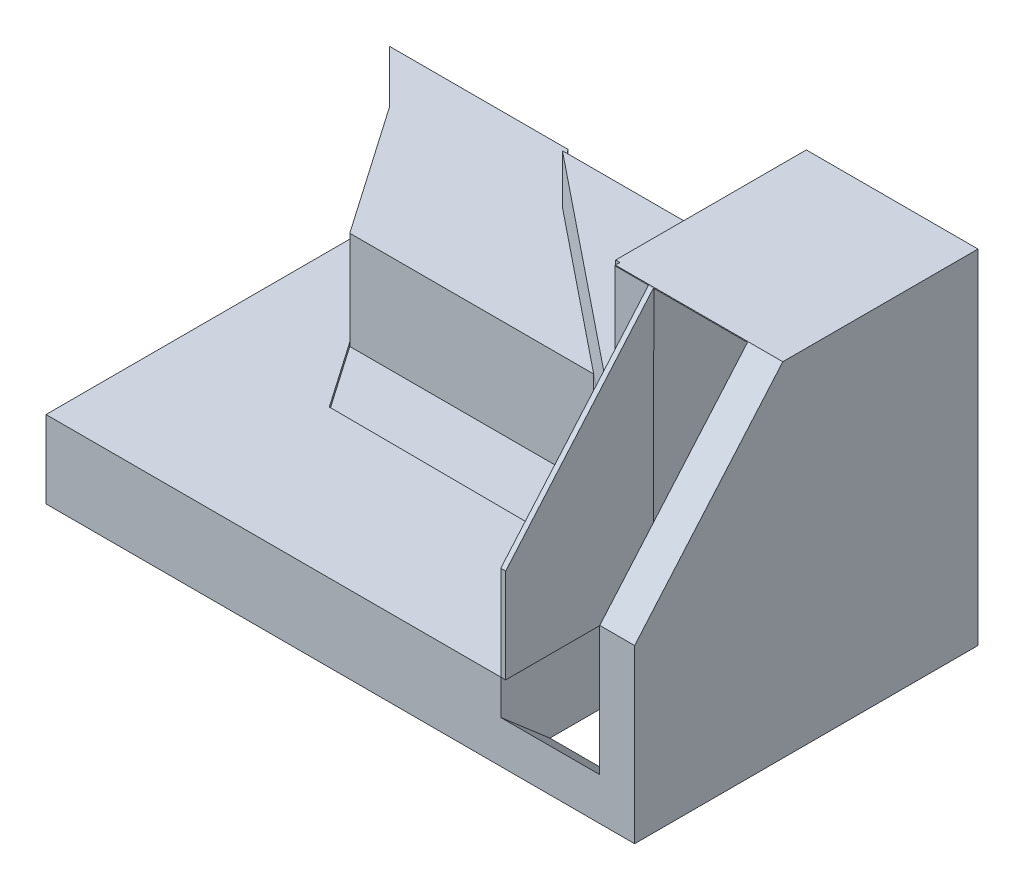
ISO-10303-21;
HEADER;
FILE_DESCRIPTION(('STEP AP214'),'2;1');
FILE_NAME('part.step','',(''),(''),'','','');
FILE_SCHEMA(('AUTOMOTIVE_DESIGN { 1 0 10303 214 1 1 1 1 }'));
ENDSEC;
DATA;
#1=APPLICATION_CONTEXT('core data for automotive mechanical design processes');
#2=APPLICATION_PROTOCOL_DEFINITION('international standard','automotive_design',2000,#1);
#3=PRODUCT_CONTEXT('',#1,'mechanical');
#4=PRODUCT('Part','Part','',(#3));
#5=PRODUCT_RELATED_PRODUCT_CATEGORY('part','',(#4));
#6=PRODUCT_DEFINITION_FORMATION('','',#4);
#7=PRODUCT_DEFINITION_CONTEXT('part definition',#1,'design');
#8=PRODUCT_DEFINITION('design','',#6,#7);
#9=PRODUCT_DEFINITION_SHAPE('','',#8);
#10=(LENGTH_UNIT() NAMED_UNIT(*) SI_UNIT(.MILLI.,.METRE.));
#11=(NAMED_UNIT(*) PLANE_ANGLE_UNIT() SI_UNIT($,.RADIAN.));
#12=(NAMED_UNIT(*) SI_UNIT($,.STERADIAN.) SOLID_ANGLE_UNIT());
#13=UNCERTAINTY_MEASURE_WITH_UNIT(LENGTH_MEASURE(1.E-05),#10,'distance_accuracy_value','');
#14=(GEOMETRIC_REPRESENTATION_CONTEXT(3) GLOBAL_UNCERTAINTY_ASSIGNED_CONTEXT((#13)) GLOBAL_UNIT_ASSIGNED_CONTEXT((#10,
#11,#12)) REPRESENTATION_CONTEXT('',''));
#15=CARTESIAN_POINT('',(0.,0.,0.));
#16=DIRECTION('',(0.,0.,1.));
#17=DIRECTION('',(1.,0.,0.));
#18=AXIS2_PLACEMENT_3D('',#15,#16,#17);
#19=CARTESIAN_POINT('',(43.8303252102302,10.,39.8821006189172));
#20=DIRECTION('',(0.,0.0016196403228152,0.999998688381752));
#21=DIRECTION('',(0.,-0.999998688381752,0.0016196403228152));
#22=AXIS2_PLACEMENT_3D('',#19,#20,#21);
#23=PLANE('',#22);
#24=DIRECTION('',(0.,0.999998688381752,-0.0016196403228152));
#25=VECTOR('',#24,1.);
#26=CARTESIAN_POINT('',(42.8303252102302,10.,39.8821006189172));
#27=LINE('',#26,#25);
#28=CARTESIAN_POINT('',(42.8303252102302,10.,39.8821006189172));
#29=VERTEX_POINT('',#28);
#30=CARTESIAN_POINT('',(42.8303252102302,64.2168674698795,39.7942886790105));
#31=VERTEX_POINT('',#30);
#32=EDGE_CURVE('E110',#29,#31,#27,.T.);
#33=ORIENTED_EDGE('',*,*,#32,.T.);
#34=DIRECTION('',(-1.,0.,0.));
#35=VECTOR('',#34,1.);
#36=CARTESIAN_POINT('',(43.8303252102302,64.2168674698795,39.7942886790105));
#37=LINE('',#36,#35);
#38=CARTESIAN_POINT('',(43.8303252102302,64.2168674698795,39.7942886790105));
#39=VERTEX_POINT('',#38);
#40=EDGE_CURVE('E12',#39,#31,#37,.T.);
#41=ORIENTED_EDGE('',*,*,#40,.F.);
#42=DIRECTION('',(0.,0.999998688381752,-0.0016196403228152));
#43=VECTOR('',#42,1.);
#44=CARTESIAN_POINT('',(43.8303252102302,10.,39.8821006189172));
#45=LINE('',#44,#43);
#46=CARTESIAN_POINT('',(43.8303252102302,10.,39.8821006189172));
#47=VERTEX_POINT('',#46);
#48=EDGE_CURVE('E97',#47,#39,#45,.T.);
#49=ORIENTED_EDGE('',*,*,#48,.F.);
#50=DIRECTION('',(-1.,0.,0.));
#51=VECTOR('',#50,1.);
#52=CARTESIAN_POINT('',(43.8303252102302,10.,39.8821006189172));
#53=LINE('',#52,#51);
#54=EDGE_CURVE('E106',#47,#29,#53,.T.);
#55=ORIENTED_EDGE('',*,*,#54,.T.);
#56=EDGE_LOOP('',(#33,#41,#49,#55));
#57=FACE_BOUND('',#56,.T.);
#58=ADVANCED_FACE('F47',(#57),#23,.F.);
#59=CARTESIAN_POINT('',(43.8303252102302,64.2168674698795,39.7942886790105));
#60=DIRECTION('',(0.,-0.653352698589413,-0.757053664706757));
#61=DIRECTION('',(0.,0.757053664706757,-0.653352698589413));
#62=AXIS2_PLACEMENT_3D('',#59,#60,#61);
#63=PLANE('',#62);
#64=DIRECTION('',(0.,-0.757053664706757,0.653352698589413));
#65=VECTOR('',#64,1.);
#66=CARTESIAN_POINT('',(42.8303252102302,64.2168674698795,39.7942886790105));
#67=LINE('',#66,#65);
#68=CARTESIAN_POINT('',(42.8303252102302,29.2168674698795,70.));
#69=VERTEX_POINT('',#68);
#70=EDGE_CURVE('E102',#31,#69,#67,.T.);
#71=ORIENTED_EDGE('',*,*,#70,.T.);
#72=DIRECTION('',(-1.,0.,0.));
#73=VECTOR('',#72,1.);
#74=CARTESIAN_POINT('',(43.8303252102302,29.2168674698795,70.));
#75=LINE('',#74,#73);
#76=CARTESIAN_POINT('',(43.8303252102302,29.2168674698795,70.));
#77=VERTEX_POINT('',#76);
#78=EDGE_CURVE('E55',#77,#69,#75,.T.);
#79=ORIENTED_EDGE('',*,*,#78,.F.);
#80=DIRECTION('',(0.,-0.757053664706757,0.653352698589413));
#81=VECTOR('',#80,1.);
#82=CARTESIAN_POINT('',(43.8303252102302,64.2168674698795,39.7942886790105));
#83=LINE('',#82,#81);
#84=EDGE_CURVE('E92',#39,#77,#83,.T.);
#85=ORIENTED_EDGE('',*,*,#84,.F.);
#86=ORIENTED_EDGE('',*,*,#40,.T.);
#87=EDGE_LOOP('',(#71,#79,#85,#86));
#88=FACE_BOUND('',#87,.T.);
#89=ADVANCED_FACE('F101',(#88),#63,.F.);
#90=CARTESIAN_POINT('',(43.8303252102302,11.7168674698795,70.));
#91=DIRECTION('',(0.,0.,-1.));
#92=DIRECTION('',(0.,1.,0.));
#93=AXIS2_PLACEMENT_3D('',#90,#91,#92);
#94=PLANE('',#93);
#95=DIRECTION('',(0.,-1.,0.));
#96=VECTOR('',#95,1.);
#97=CARTESIAN_POINT('',(42.8303252102302,11.7168674698795,70.));
#98=LINE('',#97,#96);
#99=CARTESIAN_POINT('',(42.8303252102302,10.,70.));
#100=VERTEX_POINT('',#99);
#101=EDGE_CURVE('E79',#69,#100,#98,.T.);
#102=ORIENTED_EDGE('',*,*,#101,.T.);
#103=DIRECTION('',(-1.,0.,0.));
#104=VECTOR('',#103,1.);
#105=CARTESIAN_POINT('',(43.8303252102302,10.,70.));
#106=LINE('',#105,#104);
#107=CARTESIAN_POINT('',(43.8303252102302,10.,70.));
#108=VERTEX_POINT('',#107);
#109=EDGE_CURVE('E103',#108,#100,#106,.T.);
#110=ORIENTED_EDGE('',*,*,#109,.F.);
#111=DIRECTION('',(0.,-1.,0.));
#112=VECTOR('',#111,1.);
#113=CARTESIAN_POINT('',(43.8303252102302,29.2168674698795,70.));
#114=LINE('',#113,#112);
#115=EDGE_CURVE('E95',#77,#108,#114,.T.);
#116=ORIENTED_EDGE('',*,*,#115,.F.);
#117=ORIENTED_EDGE('',*,*,#78,.T.);
#118=EDGE_LOOP('',(#102,#110,#116,#117));
#119=FACE_BOUND('',#118,.T.);
#120=ADVANCED_FACE('F104',(#119),#94,.F.);
#121=CARTESIAN_POINT('',(43.8303252102302,10.,70.));
#122=DIRECTION('',(0.,1.,0.));
#123=DIRECTION('',(0.,0.,1.));
#124=AXIS2_PLACEMENT_3D('',#121,#122,#123);
#125=PLANE('',#124);
#126=DIRECTION('',(0.,0.,-1.));
#127=VECTOR('',#126,1.);
#128=CARTESIAN_POINT('',(42.8303252102302,10.,70.));
#129=LINE('',#128,#127);
#130=EDGE_CURVE('E85',#100,#29,#129,.T.);
#131=ORIENTED_EDGE('',*,*,#130,.T.);
#132=ORIENTED_EDGE('',*,*,#54,.F.);
#133=DIRECTION('',(0.,0.,-1.));
#134=VECTOR('',#133,1.);
#135=CARTESIAN_POINT('',(43.8303252102302,10.,70.));
#136=LINE('',#135,#134);
#137=EDGE_CURVE('E63',#108,#47,#136,.T.);
#138=ORIENTED_EDGE('',*,*,#137,.F.);
#139=ORIENTED_EDGE('',*,*,#109,.T.);
#140=EDGE_LOOP('',(#131,#132,#138,#139));
#141=FACE_BOUND('',#140,.T.);
#142=ADVANCED_FACE('F117',(#141),#125,.F.);
#143=CARTESIAN_POINT('',(43.8303252102302,0.,0.));
#144=DIRECTION('',(-1.,0.,0.));
#145=DIRECTION('',(0.,0.,1.));
#146=AXIS2_PLACEMENT_3D('',#143,#144,#145);
#147=PLANE('',#146);
#148=ORIENTED_EDGE('',*,*,#48,.T.);
#149=ORIENTED_EDGE('',*,*,#84,.T.);
#150=ORIENTED_EDGE('',*,*,#115,.T.);
#151=ORIENTED_EDGE('',*,*,#137,.T.);
#152=EDGE_LOOP('',(#148,#149,#150,#151));
#153=FACE_BOUND('',#152,.T.);
#154=ADVANCED_FACE('F93',(#153),#147,.F.);
#155=CARTESIAN_POINT('',(42.8303252102302,0.,0.));
#156=DIRECTION('',(-1.,0.,0.));
#157=DIRECTION('',(0.,0.,1.));
#158=AXIS2_PLACEMENT_3D('',#155,#156,#157);
#159=PLANE('',#158);
#160=ORIENTED_EDGE('',*,*,#32,.F.);
#161=ORIENTED_EDGE('',*,*,#130,.F.);
#162=ORIENTED_EDGE('',*,*,#101,.F.);
#163=ORIENTED_EDGE('',*,*,#70,.F.);
#164=EDGE_LOOP('',(#160,#161,#162,#163));
#165=FACE_BOUND('',#164,.T.);
#166=ADVANCED_FACE('F120',(#165),#159,.T.);
#167=CLOSED_SHELL('',(#58,#89,#120,#142,#154,#166));
#168=MANIFOLD_SOLID_BREP('B2',#167);
#169=CARTESIAN_POINT('',(35.1204819277108,39.2168674698795,0.));
#170=DIRECTION('',(1.,0.,0.));
#171=DIRECTION('',(0.,0.,-1.));
#172=AXIS2_PLACEMENT_3D('',#169,#170,#171);
#173=PLANE('',#172);
#174=DIRECTION('',(0.,-1.,0.));
#175=VECTOR('',#174,1.);
#176=CARTESIAN_POINT('',(35.1204819277108,39.2168674698795,38.8717088419266));
#177=LINE('',#176,#175);
#178=CARTESIAN_POINT('',(35.1204819277108,64.2168674698795,38.8717088419266));
#179=VERTEX_POINT('',#178);
#180=CARTESIAN_POINT('',(35.1204819277108,39.2168674698795,38.8717088419266));
#181=VERTEX_POINT('',#180);
#182=EDGE_CURVE('E428',#179,#181,#177,.T.);
#183=ORIENTED_EDGE('',*,*,#182,.F.);
#184=DIRECTION('',(0.,0.,-1.));
#185=VECTOR('',#184,1.);
#186=CARTESIAN_POINT('',(35.1204819277108,64.2168674698795,0.));
#187=LINE('',#186,#185);
#188=CARTESIAN_POINT('',(35.1204819277108,64.2168674698795,0.));
#189=VERTEX_POINT('',#188);
#190=EDGE_CURVE('E482',#179,#189,#187,.T.);
#191=ORIENTED_EDGE('',*,*,#190,.T.);
#192=DIRECTION('',(0.,1.,0.));
#193=VECTOR('',#192,1.);
#194=CARTESIAN_POINT('',(35.1204819277108,39.2168674698795,0.));
#195=LINE('',#194,#193);
#196=CARTESIAN_POINT('',(35.1204819277108,39.2168674698795,0.));
#197=VERTEX_POINT('',#196);
#198=EDGE_CURVE('E488',#197,#189,#195,.T.);
#199=ORIENTED_EDGE('',*,*,#198,.F.);
#200=DIRECTION('',(0.,0.,-1.));
#201=VECTOR('',#200,1.);
#202=CARTESIAN_POINT('',(35.1204819277108,39.2168674698795,0.));
#203=LINE('',#202,#201);
#204=EDGE_CURVE('E483',#181,#197,#203,.T.);
#205=ORIENTED_EDGE('',*,*,#204,.F.);
#206=EDGE_LOOP('',(#183,#191,#199,#205));
#207=FACE_BOUND('',#206,.T.);
#208=ADVANCED_FACE('F174',(#207),#173,.F.);
#209=CARTESIAN_POINT('',(0.,39.2168674698795,0.));
#210=DIRECTION('',(0.,-1.,0.));
#211=DIRECTION('',(0.,0.,-1.));
#212=AXIS2_PLACEMENT_3D('',#209,#210,#211);
#213=PLANE('',#212);
#214=DIRECTION('',(-0.999999091798879,0.,-0.00134773937301897));
#215=VECTOR('',#214,1.);
#216=CARTESIAN_POINT('',(-0.0523250920299473,39.2168674698795,38.8243050219943));
#217=LINE('',#216,#215);
#218=CARTESIAN_POINT('',(33.7143475226182,39.2168674698795,38.869813737504));
#219=VERTEX_POINT('',#218);
#220=EDGE_CURVE('E426',#181,#219,#217,.T.);
#221=ORIENTED_EDGE('',*,*,#220,.F.);
#222=ORIENTED_EDGE('',*,*,#204,.T.);
#223=DIRECTION('',(-1.,0.,0.));
#224=VECTOR('',#223,1.);
#225=CARTESIAN_POINT('',(35.1204819277108,39.2168674698795,0.));
#226=LINE('',#225,#224);
#227=CARTESIAN_POINT('',(-14.5954870629126,39.2168674698795,0.));
#228=VERTEX_POINT('',#227);
#229=EDGE_CURVE('E485',#197,#228,#226,.T.);
#230=ORIENTED_EDGE('',*,*,#229,.T.);
#231=DIRECTION('',(0.779119686873516,0.,0.626875197727677));
#232=VECTOR('',#231,1.);
#233=CARTESIAN_POINT('',(-5.73562523725064,39.2168674698795,7.12859362608223));
#234=LINE('',#233,#232);
#235=EDGE_CURVE('E568',#228,#219,#234,.T.);
#236=ORIENTED_EDGE('',*,*,#235,.T.);
#237=EDGE_LOOP('',(#221,#222,#230,#236));
#238=FACE_BOUND('',#237,.T.);
#239=ADVANCED_FACE('F646',(#238),#213,.F.);
#240=CARTESIAN_POINT('',(34.863342776474,29.2168674698795,39.7942886790105));
#241=DIRECTION('',(0.626875197727677,0.,-0.779119686873516));
#242=DIRECTION('',(-0.779119686873516,0.,-0.626875197727677));
#243=AXIS2_PLACEMENT_3D('',#240,#241,#242);
#244=PLANE('',#243);
#245=DIRECTION('',(0.,-1.,0.));
#246=VECTOR('',#245,1.);
#247=CARTESIAN_POINT('',(33.7143475226182,29.2168674698795,38.869813737504));
#248=LINE('',#247,#246);
#249=CARTESIAN_POINT('',(33.7143475226182,29.2168674698795,38.869813737504));
#250=VERTEX_POINT('',#249);
#251=EDGE_CURVE('E423',#219,#250,#248,.T.);
#252=ORIENTED_EDGE('',*,*,#251,.F.);
#253=ORIENTED_EDGE('',*,*,#235,.F.);
#254=DIRECTION('',(0.,-1.,0.));
#255=VECTOR('',#254,1.);
#256=CARTESIAN_POINT('',(-14.5954870629126,0.,0.));
#257=LINE('',#256,#255);
#258=CARTESIAN_POINT('',(-14.5954870629126,29.2168674698795,0.));
#259=VERTEX_POINT('',#258);
#260=EDGE_CURVE('E479',#228,#259,#257,.T.);
#261=ORIENTED_EDGE('',*,*,#260,.T.);
#262=DIRECTION('',(-0.779119686873516,0.,-0.626875197727677));
#263=VECTOR('',#262,1.);
#264=CARTESIAN_POINT('',(34.863342776474,29.2168674698795,39.7942886790105));
#265=LINE('',#264,#263);
#266=CARTESIAN_POINT('',(18.0163384886347,29.2168674698795,26.2392863834868));
#267=VERTEX_POINT('',#266);
#268=EDGE_CURVE('E469',#267,#259,#265,.T.);
#269=ORIENTED_EDGE('',*,*,#268,.F.);
#270=EDGE_CURVE('E473',#250,#267,#265,.T.);
#271=ORIENTED_EDGE('',*,*,#270,.F.);
#272=EDGE_LOOP('',(#252,#253,#261,#269,#271));
#273=FACE_BOUND('',#272,.T.);
#274=ADVANCED_FACE('F582',(#273),#244,.F.);
#275=CARTESIAN_POINT('',(-49.8795180722892,64.2168674698795,70.));
#276=DIRECTION('',(0.,-1.,0.));
#277=DIRECTION('',(0.,0.,-1.));
#278=AXIS2_PLACEMENT_3D('',#275,#276,#277);
#279=PLANE('',#278);
#280=DIRECTION('',(-0.999999091798879,0.,-0.00134773937301897));
#281=VECTOR('',#280,1.);
#282=CARTESIAN_POINT('',(-22.3232538216309,64.2168674698795,38.7942895872117));
#283=LINE('',#282,#281);
#284=CARTESIAN_POINT('',(35.9799722694436,64.2168674698795,38.8728672119529));
#285=VERTEX_POINT('',#284);
#286=EDGE_CURVE('E410',#285,#179,#283,.T.);
#287=ORIENTED_EDGE('',*,*,#286,.F.);
#288=DIRECTION('',(-0.00134773937301904,0.,0.999999091798879));
#289=VECTOR('',#288,1.);
#290=CARTESIAN_POINT('',(35.9799722694436,64.2168674698795,38.8728672119529));
#291=LINE('',#290,#289);
#292=CARTESIAN_POINT('',(35.9787304323254,64.2168674698795,39.7942886790105));
#293=VERTEX_POINT('',#292);
#294=EDGE_CURVE('E415',#285,#293,#291,.T.);
#295=ORIENTED_EDGE('',*,*,#294,.T.);
#296=DIRECTION('',(1.,0.,0.));
#297=VECTOR('',#296,1.);
#298=CARTESIAN_POINT('',(-79.8795180722892,64.2168674698795,39.7942886790105));
#299=LINE('',#298,#297);
#300=CARTESIAN_POINT('',(70.1204819277108,64.2168674698795,39.7942886790105));
#301=VERTEX_POINT('',#300);
#302=EDGE_CURVE('E531',#293,#301,#299,.T.);
#303=ORIENTED_EDGE('',*,*,#302,.T.);
#304=DIRECTION('',(0.,0.,-1.));
#305=VECTOR('',#304,1.);
#306=CARTESIAN_POINT('',(70.1204819277108,64.2168674698795,70.));
#307=LINE('',#306,#305);
#308=CARTESIAN_POINT('',(70.1204819277108,64.2168674698795,0.));
#309=VERTEX_POINT('',#308);
#310=EDGE_CURVE('E542',#301,#309,#307,.T.);
#311=ORIENTED_EDGE('',*,*,#310,.T.);
#312=DIRECTION('',(-1.,0.,0.));
#313=VECTOR('',#312,1.);
#314=CARTESIAN_POINT('',(-49.8795180722892,64.2168674698795,0.));
#315=LINE('',#314,#313);
#316=EDGE_CURVE('E537',#309,#189,#315,.T.);
#317=ORIENTED_EDGE('',*,*,#316,.T.);
#318=ORIENTED_EDGE('',*,*,#190,.F.);
#319=EDGE_LOOP('',(#287,#295,#303,#311,#317,#318));
#320=FACE_BOUND('',#319,.T.);
#321=ADVANCED_FACE('F637',(#320),#279,.F.);
#322=CARTESIAN_POINT('',(-49.8795180722892,-5.78313253012048,70.));
#323=DIRECTION('',(1.,0.,0.));
#324=DIRECTION('',(0.,0.,-1.));
#325=AXIS2_PLACEMENT_3D('',#322,#323,#324);
#326=PLANE('',#325);
#327=DIRECTION('',(0.,-1.,0.));
#328=VECTOR('',#327,1.);
#329=CARTESIAN_POINT('',(-49.8795180722892,-5.78313253012048,70.));
#330=LINE('',#329,#328);
#331=CARTESIAN_POINT('',(-49.8795180722892,10.,70.));
#332=VERTEX_POINT('',#331);
#333=CARTESIAN_POINT('',(-49.8795180722892,-5.78313253012048,70.));
#334=VERTEX_POINT('',#333);
#335=EDGE_CURVE('E534',#332,#334,#330,.T.);
#336=ORIENTED_EDGE('',*,*,#335,.F.);
#337=DIRECTION('',(0.,0.,1.));
#338=VECTOR('',#337,1.);
#339=CARTESIAN_POINT('',(-49.8795180722892,10.,0.));
#340=LINE('',#339,#338);
#341=CARTESIAN_POINT('',(-49.8795180722892,10.,0.));
#342=VERTEX_POINT('',#341);
#343=EDGE_CURVE('E434',#342,#332,#340,.T.);
#344=ORIENTED_EDGE('',*,*,#343,.F.);
#345=DIRECTION('',(0.,-1.,0.));
#346=VECTOR('',#345,1.);
#347=CARTESIAN_POINT('',(-49.8795180722892,-5.78313253012048,0.));
#348=LINE('',#347,#346);
#349=CARTESIAN_POINT('',(-49.8795180722892,-5.78313253012048,0.));
#350=VERTEX_POINT('',#349);
#351=EDGE_CURVE('E533',#342,#350,#348,.T.);
#352=ORIENTED_EDGE('',*,*,#351,.T.);
#353=DIRECTION('',(0.,0.,-1.));
#354=VECTOR('',#353,1.);
#355=CARTESIAN_POINT('',(-49.8795180722892,-5.78313253012048,70.));
#356=LINE('',#355,#354);
#357=EDGE_CURVE('E556',#334,#350,#356,.T.);
#358=ORIENTED_EDGE('',*,*,#357,.F.);
#359=EDGE_LOOP('',(#336,#344,#352,#358));
#360=FACE_BOUND('',#359,.T.);
#361=ADVANCED_FACE('F176',(#360),#326,.F.);
#362=CARTESIAN_POINT('',(-49.8795180722892,-5.78313253012048,70.));
#363=DIRECTION('',(0.,1.,0.));
#364=DIRECTION('',(0.,0.,1.));
#365=AXIS2_PLACEMENT_3D('',#362,#363,#364);
#366=PLANE('',#365);
#367=ORIENTED_EDGE('',*,*,#357,.T.);
#368=DIRECTION('',(0.707106781186551,0.,0.707106781186544));
#369=VECTOR('',#368,1.);
#370=CARTESIAN_POINT('',(-49.8795180722892,-5.78313253012049,0.));
#371=LINE('',#370,#369);
#372=CARTESIAN_POINT('',(-60.6816407238513,-5.78313253012049,-10.802122651562));
#373=VERTEX_POINT('',#372);
#374=EDGE_CURVE('E456',#373,#350,#371,.T.);
#375=ORIENTED_EDGE('',*,*,#374,.F.);
#376=DIRECTION('',(-1.,0.,0.));
#377=VECTOR('',#376,1.);
#378=CARTESIAN_POINT('',(-60.6816407238513,-5.78313253012049,-10.802122651562));
#379=LINE('',#378,#377);
#380=CARTESIAN_POINT('',(-24.2893551026077,-5.78313253012049,-10.802122651562));
#381=VERTEX_POINT('',#380);
#382=EDGE_CURVE('E452',#381,#373,#379,.T.);
#383=ORIENTED_EDGE('',*,*,#382,.F.);
#384=DIRECTION('',(-0.667896590895111,0.,-0.744254085558614));
#385=VECTOR('',#384,1.);
#386=CARTESIAN_POINT('',(-24.2893551026077,-5.78313253012049,-10.802122651562));
#387=LINE('',#386,#385);
#388=CARTESIAN_POINT('',(-14.5954870629126,-5.78313253012048,0.));
#389=VERTEX_POINT('',#388);
#390=EDGE_CURVE('E449',#389,#381,#387,.T.);
#391=ORIENTED_EDGE('',*,*,#390,.F.);
#392=DIRECTION('',(1.,0.,0.));
#393=VECTOR('',#392,1.);
#394=CARTESIAN_POINT('',(-49.8795180722892,-5.78313253012048,0.));
#395=LINE('',#394,#393);
#396=CARTESIAN_POINT('',(42.8303252102302,-5.78313253012048,0.));
#397=VERTEX_POINT('',#396);
#398=EDGE_CURVE('E197',#389,#397,#395,.T.);
#399=ORIENTED_EDGE('',*,*,#398,.T.);
#400=DIRECTION('',(0.,0.,1.));
#401=VECTOR('',#400,1.);
#402=CARTESIAN_POINT('',(42.8303252102302,-5.78313253012048,70.));
#403=LINE('',#402,#401);
#404=CARTESIAN_POINT('',(42.8303252102302,-5.78313253012047,59.9812059635155));
#405=VERTEX_POINT('',#404);
#406=EDGE_CURVE('E519',#397,#405,#403,.T.);
#407=ORIENTED_EDGE('',*,*,#406,.T.);
#408=DIRECTION('',(1.,0.,0.));
#409=VECTOR('',#408,1.);
#410=CARTESIAN_POINT('',(-49.8795180722892,-5.78313253012048,59.9812059635155));
#411=LINE('',#410,#409);
#412=CARTESIAN_POINT('',(63.0080729285039,-5.78313253012047,59.9812059635155));
#413=VERTEX_POINT('',#412);
#414=EDGE_CURVE('E525',#405,#413,#411,.T.);
#415=ORIENTED_EDGE('',*,*,#414,.T.);
#416=DIRECTION('',(0.,0.,-1.));
#417=VECTOR('',#416,1.);
#418=CARTESIAN_POINT('',(63.0080729285039,-5.78313253012048,70.));
#419=LINE('',#418,#417);
#420=CARTESIAN_POINT('',(63.0080729285039,-5.78313253012048,0.));
#421=VERTEX_POINT('',#420);
#422=EDGE_CURVE('E508',#413,#421,#419,.T.);
#423=ORIENTED_EDGE('',*,*,#422,.T.);
#424=CARTESIAN_POINT('',(70.1204819277108,-5.78313253012048,0.));
#425=VERTEX_POINT('',#424);
#426=EDGE_CURVE('E547',#421,#425,#395,.T.);
#427=ORIENTED_EDGE('',*,*,#426,.T.);
#428=DIRECTION('',(0.,0.,-1.));
#429=VECTOR('',#428,1.);
#430=CARTESIAN_POINT('',(70.1204819277108,-5.78313253012048,70.));
#431=LINE('',#430,#429);
#432=CARTESIAN_POINT('',(70.1204819277108,-5.78313253012048,70.));
#433=VERTEX_POINT('',#432);
#434=EDGE_CURVE('E553',#433,#425,#431,.T.);
#435=ORIENTED_EDGE('',*,*,#434,.F.);
#436=DIRECTION('',(1.,0.,0.));
#437=VECTOR('',#436,1.);
#438=CARTESIAN_POINT('',(-49.8795180722892,-5.78313253012048,70.));
#439=LINE('',#438,#437);
#440=EDGE_CURVE('E536',#334,#433,#439,.T.);
#441=ORIENTED_EDGE('',*,*,#440,.F.);
#442=EDGE_LOOP('',(#367,#375,#383,#391,#399,#407,#415,#423,#427,#435,#441));
#443=FACE_BOUND('',#442,.T.);
#444=ADVANCED_FACE('F681',(#443),#366,.F.);
#445=CARTESIAN_POINT('',(70.1204819277108,-5.78313253012048,70.));
#446=DIRECTION('',(-1.,0.,0.));
#447=DIRECTION('',(0.,0.,1.));
#448=AXIS2_PLACEMENT_3D('',#445,#446,#447);
#449=PLANE('',#448);
#450=ORIENTED_EDGE('',*,*,#310,.F.);
#451=DIRECTION('',(0.,0.757053664706757,-0.653352698589413));
#452=VECTOR('',#451,1.);
#453=CARTESIAN_POINT('',(70.1204819277108,64.2168674698795,39.7942886790105));
#454=LINE('',#453,#452);
#455=CARTESIAN_POINT('',(70.1204819277108,29.2168674698795,70.));
#456=VERTEX_POINT('',#455);
#457=EDGE_CURVE('E528',#456,#301,#454,.T.);
#458=ORIENTED_EDGE('',*,*,#457,.F.);
#459=DIRECTION('',(0.,1.,0.));
#460=VECTOR('',#459,1.);
#461=CARTESIAN_POINT('',(70.1204819277108,-5.78313253012048,70.));
#462=LINE('',#461,#460);
#463=EDGE_CURVE('E539',#433,#456,#462,.T.);
#464=ORIENTED_EDGE('',*,*,#463,.F.);
#465=ORIENTED_EDGE('',*,*,#434,.T.);
#466=DIRECTION('',(0.,1.,0.));
#467=VECTOR('',#466,1.);
#468=CARTESIAN_POINT('',(70.1204819277108,-5.78313253012048,0.));
#469=LINE('',#468,#467);
#470=EDGE_CURVE('E546',#425,#309,#469,.T.);
#471=ORIENTED_EDGE('',*,*,#470,.T.);
#472=EDGE_LOOP('',(#450,#458,#464,#465,#471));
#473=FACE_BOUND('',#472,.T.);
#474=ADVANCED_FACE('F674',(#473),#449,.F.);
#475=CARTESIAN_POINT('',(0.,0.,70.));
#476=DIRECTION('',(0.,0.,-1.));
#477=DIRECTION('',(-1.,0.,0.));
#478=AXIS2_PLACEMENT_3D('',#475,#476,#477);
#479=PLANE('',#478);
#480=DIRECTION('',(0.,1.,0.));
#481=VECTOR('',#480,1.);
#482=CARTESIAN_POINT('',(42.8303252102302,0.,70.));
#483=LINE('',#482,#481);
#484=CARTESIAN_POINT('',(42.8303252102302,2.86329033989388,70.));
#485=VERTEX_POINT('',#484);
#486=CARTESIAN_POINT('',(42.8303252102302,10.,70.));
#487=VERTEX_POINT('',#486);
#488=EDGE_CURVE('E522',#485,#487,#483,.T.);
#489=ORIENTED_EDGE('',*,*,#488,.T.);
#490=DIRECTION('',(1.,0.,0.));
#491=VECTOR('',#490,1.);
#492=CARTESIAN_POINT('',(-49.8795180722892,10.,70.));
#493=LINE('',#492,#491);
#494=EDGE_CURVE('E436',#332,#487,#493,.T.);
#495=ORIENTED_EDGE('',*,*,#494,.F.);
#496=ORIENTED_EDGE('',*,*,#335,.T.);
#497=ORIENTED_EDGE('',*,*,#440,.T.);
#498=ORIENTED_EDGE('',*,*,#463,.T.);
#499=DIRECTION('',(-1.,0.,0.));
#500=VECTOR('',#499,1.);
#501=CARTESIAN_POINT('',(0.,29.2168674698795,70.));
#502=LINE('',#501,#500);
#503=CARTESIAN_POINT('',(63.0080729285039,29.2168674698795,70.));
#504=VERTEX_POINT('',#503);
#505=EDGE_CURVE('E559',#456,#504,#502,.T.);
#506=ORIENTED_EDGE('',*,*,#505,.T.);
#507=DIRECTION('',(0.,-1.,0.));
#508=VECTOR('',#507,1.);
#509=CARTESIAN_POINT('',(63.0080729285039,0.,70.));
#510=LINE('',#509,#508);
#511=CARTESIAN_POINT('',(63.0080729285039,2.86329033989388,70.));
#512=VERTEX_POINT('',#511);
#513=EDGE_CURVE('E511',#504,#512,#510,.T.);
#514=ORIENTED_EDGE('',*,*,#513,.T.);
#515=DIRECTION('',(-1.,0.,0.));
#516=VECTOR('',#515,1.);
#517=CARTESIAN_POINT('',(0.,2.86329033989386,70.));
#518=LINE('',#517,#516);
#519=EDGE_CURVE('E565',#512,#485,#518,.T.);
#520=ORIENTED_EDGE('',*,*,#519,.T.);
#521=EDGE_LOOP('',(#489,#495,#496,#497,#498,#506,#514,#520));
#522=FACE_BOUND('',#521,.T.);
#523=ADVANCED_FACE('F671',(#522),#479,.F.);
#524=CARTESIAN_POINT('',(0.,0.,0.));
#525=DIRECTION('',(0.,0.,-1.));
#526=DIRECTION('',(-1.,0.,0.));
#527=AXIS2_PLACEMENT_3D('',#524,#525,#526);
#528=PLANE('',#527);
#529=DIRECTION('',(0.,1.,0.));
#530=VECTOR('',#529,1.);
#531=CARTESIAN_POINT('',(-14.5954870629126,-5.78313253012049,0.));
#532=LINE('',#531,#530);
#533=EDGE_CURVE('E459',#389,#259,#532,.T.);
#534=ORIENTED_EDGE('',*,*,#533,.T.);
#535=ORIENTED_EDGE('',*,*,#260,.F.);
#536=ORIENTED_EDGE('',*,*,#229,.F.);
#537=ORIENTED_EDGE('',*,*,#198,.T.);
#538=ORIENTED_EDGE('',*,*,#316,.F.);
#539=ORIENTED_EDGE('',*,*,#470,.F.);
#540=ORIENTED_EDGE('',*,*,#426,.F.);
#541=DIRECTION('',(0.,-1.,0.));
#542=VECTOR('',#541,1.);
#543=CARTESIAN_POINT('',(63.0080729285039,0.,0.));
#544=LINE('',#543,#542);
#545=CARTESIAN_POINT('',(63.0080729285039,29.6960545316058,0.));
#546=VERTEX_POINT('',#545);
#547=EDGE_CURVE('E499',#546,#421,#544,.T.);
#548=ORIENTED_EDGE('',*,*,#547,.F.);
#549=DIRECTION('',(1.,0.,0.));
#550=VECTOR('',#549,1.);
#551=CARTESIAN_POINT('',(0.,29.6960545316058,0.));
#552=LINE('',#551,#550);
#553=CARTESIAN_POINT('',(42.8303252102302,29.6960545316058,0.));
#554=VERTEX_POINT('',#553);
#555=EDGE_CURVE('E514',#554,#546,#552,.T.);
#556=ORIENTED_EDGE('',*,*,#555,.F.);
#557=DIRECTION('',(0.,1.,0.));
#558=VECTOR('',#557,1.);
#559=CARTESIAN_POINT('',(42.8303252102302,0.,0.));
#560=LINE('',#559,#558);
#561=EDGE_CURVE('E517',#397,#554,#560,.T.);
#562=ORIENTED_EDGE('',*,*,#561,.F.);
#563=ORIENTED_EDGE('',*,*,#398,.F.);
#564=EDGE_LOOP('',(#534,#535,#536,#537,#538,#539,#540,#548,#556,#562,#563));
#565=FACE_BOUND('',#564,.T.);
#566=ADVANCED_FACE('F643',(#565),#528,.T.);
#567=CARTESIAN_POINT('',(-79.8795180722892,64.2168674698795,39.7942886790105));
#568=DIRECTION('',(0.,-0.653352698589413,-0.757053664706757));
#569=DIRECTION('',(0.,0.757053664706757,-0.653352698589413));
#570=AXIS2_PLACEMENT_3D('',#567,#568,#569);
#571=PLANE('',#570);
#572=ORIENTED_EDGE('',*,*,#302,.F.);
#573=DIRECTION('',(-0.000880549614698619,-0.75705337120925,0.6533524452951));
#574=VECTOR('',#573,1.);
#575=CARTESIAN_POINT('',(35.9786405995906,64.1396336903927,39.8609430003651));
#576=LINE('',#575,#574);
#577=CARTESIAN_POINT('',(35.9786245300705,64.1258179052221,39.8728663037518));
#578=VERTEX_POINT('',#577);
#579=EDGE_CURVE('E418',#293,#578,#576,.T.);
#580=ORIENTED_EDGE('',*,*,#579,.T.);
#581=DIRECTION('',(0.999997872420188,-0.00156165236551381,0.00134773772961287));
#582=VECTOR('',#581,1.);
#583=CARTESIAN_POINT('',(-79.8792731671927,64.3067480501678,39.7167199115376));
#584=LINE('',#583,#582);
#585=CARTESIAN_POINT('',(42.8303252102302,64.1151179078821,39.8821006189172));
#586=VERTEX_POINT('',#585);
#587=EDGE_CURVE('E446',#578,#586,#584,.T.);
#588=ORIENTED_EDGE('',*,*,#587,.T.);
#589=DIRECTION('',(-1.,0.,0.));
#590=VECTOR('',#589,1.);
#591=CARTESIAN_POINT('',(42.8303252102302,64.1151179078821,39.8821006189172));
#592=LINE('',#591,#590);
#593=CARTESIAN_POINT('',(63.0080729285039,64.1151179078821,39.8821006189172));
#594=VERTEX_POINT('',#593);
#595=EDGE_CURVE('E492',#594,#586,#592,.T.);
#596=ORIENTED_EDGE('',*,*,#595,.F.);
#597=DIRECTION('',(0.,-0.757053664706757,0.653352698589413));
#598=VECTOR('',#597,1.);
#599=CARTESIAN_POINT('',(63.0080729285039,64.2168674698795,39.7942886790105));
#600=LINE('',#599,#598);
#601=EDGE_CURVE('E562',#594,#504,#600,.T.);
#602=ORIENTED_EDGE('',*,*,#601,.T.);
#603=ORIENTED_EDGE('',*,*,#505,.F.);
#604=ORIENTED_EDGE('',*,*,#457,.T.);
#605=EDGE_LOOP('',(#572,#580,#588,#596,#602,#603,#604));
#606=FACE_BOUND('',#605,.T.);
#607=ADVANCED_FACE('F624',(#606),#571,.F.);
#608=CARTESIAN_POINT('',(63.0080729285039,-83.8900696002702,-30.5229628807257));
#609=DIRECTION('',(0.,-0.757053664706757,0.653352698589414));
#610=DIRECTION('',(0.,-0.653352698589414,-0.757053664706757));
#611=AXIS2_PLACEMENT_3D('',#608,#609,#610);
#612=PLANE('',#611);
#613=DIRECTION('',(0.,0.653352698589414,0.757053664706757));
#614=VECTOR('',#613,1.);
#615=CARTESIAN_POINT('',(42.8303252102302,-83.8900696002702,-30.5229628807257));
#616=LINE('',#615,#614);
#617=EDGE_CURVE('E495',#405,#485,#616,.T.);
#618=ORIENTED_EDGE('',*,*,#617,.T.);
#619=ORIENTED_EDGE('',*,*,#519,.F.);
#620=DIRECTION('',(0.,0.653352698589414,0.757053664706757));
#621=VECTOR('',#620,1.);
#622=CARTESIAN_POINT('',(63.0080729285039,-83.8900696002702,-30.5229628807257));
#623=LINE('',#622,#621);
#624=EDGE_CURVE('E502',#413,#512,#623,.T.);
#625=ORIENTED_EDGE('',*,*,#624,.F.);
#626=ORIENTED_EDGE('',*,*,#414,.F.);
#627=EDGE_LOOP('',(#618,#619,#625,#626));
#628=FACE_BOUND('',#627,.T.);
#629=ADVANCED_FACE('F663',(#628),#612,.F.);
#630=CARTESIAN_POINT('',(42.8303252102302,-83.8900696002702,-30.5229628807257));
#631=DIRECTION('',(-1.,0.,0.));
#632=DIRECTION('',(0.,0.,1.));
#633=AXIS2_PLACEMENT_3D('',#630,#631,#632);
#634=PLANE('',#633);
#635=DIRECTION('',(0.,0.653352698589414,0.757053664706757));
#636=VECTOR('',#635,1.);
#637=CARTESIAN_POINT('',(42.8303252102302,-33.88778688053,-73.6759490870963));
#638=LINE('',#637,#636);
#639=EDGE_CURVE('E496',#554,#586,#638,.T.);
#640=ORIENTED_EDGE('',*,*,#639,.T.);
#641=DIRECTION('',(0.,1.,0.));
#642=VECTOR('',#641,1.);
#643=CARTESIAN_POINT('',(42.8303252102302,10.,39.8821006189172));
#644=LINE('',#643,#642);
#645=CARTESIAN_POINT('',(42.8303252102302,10.,39.8821006189172));
#646=VERTEX_POINT('',#645);
#647=EDGE_CURVE('E443',#646,#586,#644,.T.);
#648=ORIENTED_EDGE('',*,*,#647,.F.);
#649=DIRECTION('',(0.,0.,-1.));
#650=VECTOR('',#649,1.);
#651=CARTESIAN_POINT('',(42.8303252102302,10.,70.));
#652=LINE('',#651,#650);
#653=EDGE_CURVE('E438',#487,#646,#652,.T.);
#654=ORIENTED_EDGE('',*,*,#653,.F.);
#655=ORIENTED_EDGE('',*,*,#488,.F.);
#656=ORIENTED_EDGE('',*,*,#617,.F.);
#657=ORIENTED_EDGE('',*,*,#406,.F.);
#658=ORIENTED_EDGE('',*,*,#561,.T.);
#659=EDGE_LOOP('',(#640,#648,#654,#655,#656,#657,#658));
#660=FACE_BOUND('',#659,.T.);
#661=ADVANCED_FACE('F614',(#660),#634,.F.);
#662=CARTESIAN_POINT('',(63.0080729285039,-33.88778688053,-73.6759490870964));
#663=DIRECTION('',(1.,0.,0.));
#664=DIRECTION('',(0.,0.,-1.));
#665=AXIS2_PLACEMENT_3D('',#662,#663,#664);
#666=PLANE('',#665);
#667=ORIENTED_EDGE('',*,*,#601,.F.);
#668=DIRECTION('',(0.,0.653352698589414,0.757053664706757));
#669=VECTOR('',#668,1.);
#670=CARTESIAN_POINT('',(63.0080729285039,-33.88778688053,-73.6759490870964));
#671=LINE('',#670,#669);
#672=EDGE_CURVE('E500',#546,#594,#671,.T.);
#673=ORIENTED_EDGE('',*,*,#672,.F.);
#674=ORIENTED_EDGE('',*,*,#547,.T.);
#675=ORIENTED_EDGE('',*,*,#422,.F.);
#676=ORIENTED_EDGE('',*,*,#624,.T.);
#677=ORIENTED_EDGE('',*,*,#513,.F.);
#678=EDGE_LOOP('',(#667,#673,#674,#675,#676,#677));
#679=FACE_BOUND('',#678,.T.);
#680=ADVANCED_FACE('F659',(#679),#666,.F.);
#681=CARTESIAN_POINT('',(42.8303252102302,-33.88778688053,-73.6759490870963));
#682=DIRECTION('',(0.,0.757053664706757,-0.653352698589414));
#683=DIRECTION('',(0.,0.653352698589414,0.757053664706757));
#684=AXIS2_PLACEMENT_3D('',#681,#682,#683);
#685=PLANE('',#684);
#686=ORIENTED_EDGE('',*,*,#555,.T.);
#687=ORIENTED_EDGE('',*,*,#672,.T.);
#688=ORIENTED_EDGE('',*,*,#595,.T.);
#689=ORIENTED_EDGE('',*,*,#639,.F.);
#690=EDGE_LOOP('',(#686,#687,#688,#689));
#691=FACE_BOUND('',#690,.T.);
#692=ADVANCED_FACE('F620',(#691),#685,.F.);
#693=CARTESIAN_POINT('',(0.,29.2168674698795,0.));
#694=DIRECTION('',(0.,1.,0.));
#695=DIRECTION('',(0.,0.,1.));
#696=AXIS2_PLACEMENT_3D('',#693,#694,#695);
#697=PLANE('',#696);
#698=DIRECTION('',(-1.,0.,0.));
#699=VECTOR('',#698,1.);
#700=CARTESIAN_POINT('',(18.0163384886347,29.2168674698795,26.2392863834868));
#701=LINE('',#700,#699);
#702=CARTESIAN_POINT('',(-31.710545347466,29.2168674698795,26.2392863834868));
#703=VERTEX_POINT('',#702);
#704=EDGE_CURVE('E371',#267,#703,#701,.T.);
#705=ORIENTED_EDGE('',*,*,#704,.F.);
#706=ORIENTED_EDGE('',*,*,#268,.T.);
#707=DIRECTION('',(-0.667896590895111,0.,-0.744254085558614));
#708=VECTOR('',#707,1.);
#709=CARTESIAN_POINT('',(-24.2893551026077,29.2168674698795,-10.802122651562));
#710=LINE('',#709,#708);
#711=CARTESIAN_POINT('',(-24.2893551026077,29.2168674698795,-10.802122651562));
#712=VERTEX_POINT('',#711);
#713=EDGE_CURVE('E448',#259,#712,#710,.T.);
#714=ORIENTED_EDGE('',*,*,#713,.T.);
#715=DIRECTION('',(-1.,0.,0.));
#716=VECTOR('',#715,1.);
#717=CARTESIAN_POINT('',(-60.6816407238513,29.2168674698795,-10.802122651562));
#718=LINE('',#717,#716);
#719=CARTESIAN_POINT('',(-60.6816407238513,29.2168674698795,-10.802122651562));
#720=VERTEX_POINT('',#719);
#721=EDGE_CURVE('E462',#712,#720,#718,.T.);
#722=ORIENTED_EDGE('',*,*,#721,.T.);
#723=DIRECTION('',(0.707106781186551,0.,0.707106781186544));
#724=VECTOR('',#723,1.);
#725=CARTESIAN_POINT('',(-49.8795180722892,29.2168674698795,0.));
#726=LINE('',#725,#724);
#727=CARTESIAN_POINT('',(-49.8795180722892,29.2168674698795,0.));
#728=VERTEX_POINT('',#727);
#729=EDGE_CURVE('E453',#720,#728,#726,.T.);
#730=ORIENTED_EDGE('',*,*,#729,.T.);
#731=DIRECTION('',(0.569280147072024,0.,0.822143609200762));
#732=VECTOR('',#731,1.);
#733=CARTESIAN_POINT('',(-49.8795180722892,29.2168674698795,0.));
#734=LINE('',#733,#732);
#735=EDGE_CURVE('E476',#728,#703,#734,.T.);
#736=ORIENTED_EDGE('',*,*,#735,.T.);
#737=EDGE_LOOP('',(#705,#706,#714,#722,#730,#736));
#738=FACE_BOUND('',#737,.T.);
#739=ADVANCED_FACE('F585',(#738),#697,.T.);
#740=CARTESIAN_POINT('',(-49.8795180722892,-5.78313253012049,0.));
#741=DIRECTION('',(-0.707106781186544,0.,0.707106781186551));
#742=DIRECTION('',(0.707106781186551,0.,0.707106781186544));
#743=AXIS2_PLACEMENT_3D('',#740,#741,#742);
#744=PLANE('',#743);
#745=ORIENTED_EDGE('',*,*,#729,.F.);
#746=DIRECTION('',(0.,1.,0.));
#747=VECTOR('',#746,1.);
#748=CARTESIAN_POINT('',(-60.6816407238513,-5.78313253012049,-10.802122651562));
#749=LINE('',#748,#747);
#750=EDGE_CURVE('E467',#373,#720,#749,.T.);
#751=ORIENTED_EDGE('',*,*,#750,.F.);
#752=ORIENTED_EDGE('',*,*,#374,.T.);
#753=ORIENTED_EDGE('',*,*,#351,.F.);
#754=EDGE_CURVE('E544',#728,#342,#348,.T.);
#755=ORIENTED_EDGE('',*,*,#754,.F.);
#756=EDGE_LOOP('',(#745,#751,#752,#753,#755));
#757=FACE_BOUND('',#756,.T.);
#758=ADVANCED_FACE('F698',(#757),#744,.T.);
#759=CARTESIAN_POINT('',(-60.6816407238513,-5.78313253012049,-10.802122651562));
#760=DIRECTION('',(0.,0.,-1.));
#761=DIRECTION('',(-1.,0.,0.));
#762=AXIS2_PLACEMENT_3D('',#759,#760,#761);
#763=PLANE('',#762);
#764=ORIENTED_EDGE('',*,*,#721,.F.);
#765=DIRECTION('',(0.,1.,0.));
#766=VECTOR('',#765,1.);
#767=CARTESIAN_POINT('',(-24.2893551026077,-5.78313253012049,-10.802122651562));
#768=LINE('',#767,#766);
#769=EDGE_CURVE('E470',#381,#712,#768,.T.);
#770=ORIENTED_EDGE('',*,*,#769,.F.);
#771=ORIENTED_EDGE('',*,*,#382,.T.);
#772=ORIENTED_EDGE('',*,*,#750,.T.);
#773=EDGE_LOOP('',(#764,#770,#771,#772));
#774=FACE_BOUND('',#773,.T.);
#775=ADVANCED_FACE('F702',(#774),#763,.T.);
#776=CARTESIAN_POINT('',(-24.2893551026077,-5.78313253012049,-10.802122651562));
#777=DIRECTION('',(0.744254085558614,0.,-0.667896590895111));
#778=DIRECTION('',(-0.667896590895111,0.,-0.744254085558614));
#779=AXIS2_PLACEMENT_3D('',#776,#777,#778);
#780=PLANE('',#779);
#781=ORIENTED_EDGE('',*,*,#713,.F.);
#782=ORIENTED_EDGE('',*,*,#533,.F.);
#783=ORIENTED_EDGE('',*,*,#390,.T.);
#784=ORIENTED_EDGE('',*,*,#769,.T.);
#785=EDGE_LOOP('',(#781,#782,#783,#784));
#786=FACE_BOUND('',#785,.T.);
#787=ADVANCED_FACE('F705',(#786),#780,.T.);
#788=CARTESIAN_POINT('',(42.8303252102302,10.,39.8821006189172));
#789=DIRECTION('',(0.00134773937301904,0.,-0.999999091798879));
#790=DIRECTION('',(-0.999999091798879,0.,-0.00134773937301904));
#791=AXIS2_PLACEMENT_3D('',#788,#789,#790);
#792=PLANE('',#791);
#793=DIRECTION('',(0.999999091798879,0.,0.00134773937301897));
#794=VECTOR('',#793,1.);
#795=CARTESIAN_POINT('',(-22.3246015610039,28.5918276660121,39.7942886790105));
#796=LINE('',#795,#794);
#797=CARTESIAN_POINT('',(34.9607535191459,28.5918276660121,39.8714944776678));
#798=VERTEX_POINT('',#797);
#799=CARTESIAN_POINT('',(35.9786245300705,28.5918276660121,39.8728663037518));
#800=VERTEX_POINT('',#799);
#801=EDGE_CURVE('E403',#798,#800,#796,.T.);
#802=ORIENTED_EDGE('',*,*,#801,.F.);
#803=DIRECTION('',(0.,-1.,0.));
#804=VECTOR('',#803,1.);
#805=CARTESIAN_POINT('',(34.9607535191459,10.,39.8714944776678));
#806=LINE('',#805,#804);
#807=CARTESIAN_POINT('',(34.9607535191459,10.,39.8714944776678));
#808=VERTEX_POINT('',#807);
#809=EDGE_CURVE('E189',#798,#808,#806,.T.);
#810=ORIENTED_EDGE('',*,*,#809,.T.);
#811=DIRECTION('',(-0.999999091798879,0.,-0.00134773937301904));
#812=VECTOR('',#811,1.);
#813=CARTESIAN_POINT('',(42.8303252102302,10.,39.8821006189172));
#814=LINE('',#813,#812);
#815=EDGE_CURVE('E440',#646,#808,#814,.T.);
#816=ORIENTED_EDGE('',*,*,#815,.F.);
#817=ORIENTED_EDGE('',*,*,#647,.T.);
#818=ORIENTED_EDGE('',*,*,#587,.F.);
#819=DIRECTION('',(0.,1.,0.));
#820=VECTOR('',#819,1.);
#821=CARTESIAN_POINT('',(35.9786245300705,64.2168674698795,39.8728663037518));
#822=LINE('',#821,#820);
#823=EDGE_CURVE('E407',#800,#578,#822,.T.);
#824=ORIENTED_EDGE('',*,*,#823,.F.);
#825=EDGE_LOOP('',(#802,#810,#816,#817,#818,#824));
#826=FACE_BOUND('',#825,.T.);
#827=ADVANCED_FACE('F611',(#826),#792,.F.);
#828=CARTESIAN_POINT('',(-22.3246015610039,10.,39.7942886790105));
#829=DIRECTION('',(0.822143609200762,0.,-0.569280147072024));
#830=DIRECTION('',(-0.569280147072024,0.,-0.822143609200762));
#831=AXIS2_PLACEMENT_3D('',#828,#829,#830);
#832=PLANE('',#831);
#833=DIRECTION('',(-0.569280147072024,0.,-0.822143609200761));
#834=VECTOR('',#833,1.);
#835=CARTESIAN_POINT('',(-22.3246015610039,10.,39.7942886790105));
#836=LINE('',#835,#834);
#837=CARTESIAN_POINT('',(-31.710545347466,9.99999999999997,26.2392863834868));
#838=VERTEX_POINT('',#837);
#839=EDGE_CURVE('E430',#838,#342,#836,.T.);
#840=ORIENTED_EDGE('',*,*,#839,.F.);
#841=DIRECTION('',(0.,1.,0.));
#842=VECTOR('',#841,1.);
#843=CARTESIAN_POINT('',(-31.710545347466,9.21686746987952,26.2392863834868));
#844=LINE('',#843,#842);
#845=EDGE_CURVE('E596',#838,#703,#844,.T.);
#846=ORIENTED_EDGE('',*,*,#845,.T.);
#847=ORIENTED_EDGE('',*,*,#735,.F.);
#848=ORIENTED_EDGE('',*,*,#754,.T.);
#849=EDGE_LOOP('',(#840,#846,#847,#848));
#850=FACE_BOUND('',#849,.T.);
#851=ADVANCED_FACE('F712',(#850),#832,.F.);
#852=CARTESIAN_POINT('',(0.,9.99999999999997,0.));
#853=DIRECTION('',(0.,-1.,0.));
#854=DIRECTION('',(0.,0.,-1.));
#855=AXIS2_PLACEMENT_3D('',#852,#853,#854);
#856=PLANE('',#855);
#857=DIRECTION('',(-1.,0.,0.));
#858=VECTOR('',#857,1.);
#859=CARTESIAN_POINT('',(0.,9.99999999999997,40.));
#860=LINE('',#859,#858);
#861=CARTESIAN_POINT('',(35.1204819277108,9.99999999999997,40.));
#862=VERTEX_POINT('',#861);
#863=CARTESIAN_POINT('',(18.0163384886347,9.99999999999997,40.));
#864=VERTEX_POINT('',#863);
#865=EDGE_CURVE('E45',#862,#864,#860,.T.);
#866=ORIENTED_EDGE('',*,*,#865,.T.);
#867=DIRECTION('',(-0.999986998726559,0.,-0.00509925267550124));
#868=VECTOR('',#867,1.);
#869=CARTESIAN_POINT('',(-0.203498987508085,9.99999999999997,39.9070912370704));
#870=LINE('',#869,#868);
#871=CARTESIAN_POINT('',(-22.3246015610039,9.99999999999997,39.7942886790105));
#872=VERTEX_POINT('',#871);
#873=EDGE_CURVE('E395',#864,#872,#870,.T.);
#874=ORIENTED_EDGE('',*,*,#873,.T.);
#875=EDGE_CURVE('E431',#872,#838,#836,.T.);
#876=ORIENTED_EDGE('',*,*,#875,.T.);
#877=ORIENTED_EDGE('',*,*,#839,.T.);
#878=ORIENTED_EDGE('',*,*,#343,.T.);
#879=ORIENTED_EDGE('',*,*,#494,.T.);
#880=ORIENTED_EDGE('',*,*,#653,.T.);
#881=ORIENTED_EDGE('',*,*,#815,.T.);
#882=DIRECTION('',(0.779145969669357,0.,0.626842530423708));
#883=VECTOR('',#882,1.);
#884=CARTESIAN_POINT('',(-5.73612756813905,9.99999999999997,7.12982999606594));
#885=LINE('',#884,#883);
#886=EDGE_CURVE('E400',#808,#862,#885,.T.);
#887=ORIENTED_EDGE('',*,*,#886,.T.);
#888=EDGE_LOOP('',(#866,#874,#876,#877,#878,#879,#880,#881,#887));
#889=FACE_BOUND('',#888,.T.);
#890=ADVANCED_FACE('F599',(#889),#856,.F.);
#891=CARTESIAN_POINT('',(-0.0523250920299472,0.,38.8243050219943));
#892=DIRECTION('',(-0.00134773937301897,0.,0.999999091798879));
#893=DIRECTION('',(0.999999091798879,0.,0.00134773937301897));
#894=AXIS2_PLACEMENT_3D('',#891,#892,#893);
#895=PLANE('',#894);
#896=DIRECTION('',(0.,1.,0.));
#897=VECTOR('',#896,1.);
#898=CARTESIAN_POINT('',(33.7156974545534,0.,38.869815556862));
#899=LINE('',#898,#897);
#900=CARTESIAN_POINT('',(33.7156974545534,28.5918276660121,38.869815556862));
#901=VERTEX_POINT('',#900);
#902=CARTESIAN_POINT('',(33.7156974545534,29.2168674698795,38.869815556862));
#903=VERTEX_POINT('',#902);
#904=EDGE_CURVE('E381',#901,#903,#899,.T.);
#905=ORIENTED_EDGE('',*,*,#904,.F.);
#906=DIRECTION('',(0.999999091798879,0.,0.00134773937301897));
#907=VECTOR('',#906,1.);
#908=CARTESIAN_POINT('',(-22.3232538216309,28.5918276660121,38.7942895872117));
#909=LINE('',#908,#907);
#910=CARTESIAN_POINT('',(35.9799722694436,28.5918276660121,38.8728672119529));
#911=VERTEX_POINT('',#910);
#912=EDGE_CURVE('E404',#901,#911,#909,.T.);
#913=ORIENTED_EDGE('',*,*,#912,.T.);
#914=DIRECTION('',(0.,1.,0.));
#915=VECTOR('',#914,1.);
#916=CARTESIAN_POINT('',(35.9799722694436,64.2168674698795,38.8728672119529));
#917=LINE('',#916,#915);
#918=EDGE_CURVE('E406',#911,#285,#917,.T.);
#919=ORIENTED_EDGE('',*,*,#918,.T.);
#920=ORIENTED_EDGE('',*,*,#286,.T.);
#921=ORIENTED_EDGE('',*,*,#182,.T.);
#922=ORIENTED_EDGE('',*,*,#220,.T.);
#923=ORIENTED_EDGE('',*,*,#251,.T.);
#924=DIRECTION('',(-0.999999091798879,0.,-0.00134773937301897));
#925=VECTOR('',#924,1.);
#926=CARTESIAN_POINT('',(-0.0523250920299472,29.2168674698795,38.8243050219943));
#927=LINE('',#926,#925);
#928=EDGE_CURVE('E182',#903,#250,#927,.T.);
#929=ORIENTED_EDGE('',*,*,#928,.F.);
#930=EDGE_LOOP('',(#905,#913,#919,#920,#921,#922,#923,#929));
#931=FACE_BOUND('',#930,.T.);
#932=ADVANCED_FACE('F579',(#931),#895,.T.);
#933=CARTESIAN_POINT('',(35.9799722694436,64.2168674698795,38.8728672119529));
#934=DIRECTION('',(0.999999091798879,0.,0.00134773937301904));
#935=DIRECTION('',(0.00134773937301904,0.,-0.999999091798879));
#936=AXIS2_PLACEMENT_3D('',#933,#934,#935);
#937=PLANE('',#936);
#938=ORIENTED_EDGE('',*,*,#294,.F.);
#939=ORIENTED_EDGE('',*,*,#918,.F.);
#940=DIRECTION('',(-0.00134773937301904,0.,0.999999091798879));
#941=VECTOR('',#940,1.);
#942=CARTESIAN_POINT('',(35.9799722694436,28.5918276660121,38.8728672119529));
#943=LINE('',#942,#941);
#944=EDGE_CURVE('E412',#911,#800,#943,.T.);
#945=ORIENTED_EDGE('',*,*,#944,.T.);
#946=ORIENTED_EDGE('',*,*,#823,.T.);
#947=ORIENTED_EDGE('',*,*,#579,.F.);
#948=EDGE_LOOP('',(#938,#939,#945,#946,#947));
#949=FACE_BOUND('',#948,.T.);
#950=ADVANCED_FACE('F627',(#949),#937,.F.);
#951=CARTESIAN_POINT('',(-22.3232538216309,28.5918276660121,38.7942895872117));
#952=DIRECTION('',(0.,-1.,0.));
#953=DIRECTION('',(0.,0.,-1.));
#954=AXIS2_PLACEMENT_3D('',#951,#952,#953);
#955=PLANE('',#954);
#956=ORIENTED_EDGE('',*,*,#912,.F.);
#957=DIRECTION('',(0.779145969669357,0.,0.626842530423708));
#958=VECTOR('',#957,1.);
#959=CARTESIAN_POINT('',(-0.34066841278808,28.5918276660121,11.4706125982954));
#960=LINE('',#959,#958);
#961=EDGE_CURVE('E571',#901,#798,#960,.T.);
#962=ORIENTED_EDGE('',*,*,#961,.T.);
#963=ORIENTED_EDGE('',*,*,#801,.T.);
#964=ORIENTED_EDGE('',*,*,#944,.F.);
#965=EDGE_LOOP('',(#956,#962,#963,#964));
#966=FACE_BOUND('',#965,.T.);
#967=ADVANCED_FACE('F632',(#966),#955,.F.);
#968=CARTESIAN_POINT('',(18.0163384886347,9.21686746987952,40.));
#969=DIRECTION('',(0.,0.,1.));
#970=DIRECTION('',(1.,0.,0.));
#971=AXIS2_PLACEMENT_3D('',#968,#969,#970);
#972=PLANE('',#971);
#973=DIRECTION('',(0.,1.,0.));
#974=VECTOR('',#973,1.);
#975=CARTESIAN_POINT('',(35.1204819277108,9.21686746987952,40.));
#976=LINE('',#975,#974);
#977=CARTESIAN_POINT('',(35.1204819277108,9.21686746987952,40.));
#978=VERTEX_POINT('',#977);
#979=EDGE_CURVE('E382',#978,#862,#976,.T.);
#980=ORIENTED_EDGE('',*,*,#979,.F.);
#981=DIRECTION('',(1.,0.,0.));
#982=VECTOR('',#981,1.);
#983=CARTESIAN_POINT('',(18.0163384886347,9.21686746987952,40.));
#984=LINE('',#983,#982);
#985=CARTESIAN_POINT('',(18.0163384886347,9.21686746987952,40.));
#986=VERTEX_POINT('',#985);
#987=EDGE_CURVE('E387',#986,#978,#984,.T.);
#988=ORIENTED_EDGE('',*,*,#987,.F.);
#989=DIRECTION('',(0.,1.,0.));
#990=VECTOR('',#989,1.);
#991=CARTESIAN_POINT('',(18.0163384886347,9.21686746987952,40.));
#992=LINE('',#991,#990);
#993=EDGE_CURVE('E388',#986,#864,#992,.T.);
#994=ORIENTED_EDGE('',*,*,#993,.T.);
#995=ORIENTED_EDGE('',*,*,#865,.F.);
#996=EDGE_LOOP('',(#980,#988,#994,#995));
#997=FACE_BOUND('',#996,.T.);
#998=ADVANCED_FACE('F605',(#997),#972,.F.);
#999=CARTESIAN_POINT('',(0.,29.2168674698795,0.));
#1000=DIRECTION('',(0.,1.,0.));
#1001=DIRECTION('',(0.,0.,1.));
#1002=AXIS2_PLACEMENT_3D('',#999,#1000,#1001);
#1003=PLANE('',#1002);
#1004=DIRECTION('',(-0.779145969669357,0.,-0.626842530423708));
#1005=VECTOR('',#1004,1.);
#1006=CARTESIAN_POINT('',(18.0163384886347,29.2168674698795,26.2392863834868));
#1007=LINE('',#1006,#1005);
#1008=EDGE_CURVE('E379',#903,#267,#1007,.T.);
#1009=ORIENTED_EDGE('',*,*,#1008,.F.);
#1010=ORIENTED_EDGE('',*,*,#928,.T.);
#1011=ORIENTED_EDGE('',*,*,#270,.T.);
#1012=EDGE_LOOP('',(#1009,#1010,#1011));
#1013=FACE_BOUND('',#1012,.T.);
#1014=ADVANCED_FACE('F574',(#1013),#1003,.F.);
#1015=CARTESIAN_POINT('',(18.0163384886347,9.21686746987952,26.2392863834868));
#1016=DIRECTION('',(0.626842530423708,0.,-0.779145969669357));
#1017=DIRECTION('',(-0.779145969669357,0.,-0.626842530423708));
#1018=AXIS2_PLACEMENT_3D('',#1015,#1016,#1017);
#1019=PLANE('',#1018);
#1020=ORIENTED_EDGE('',*,*,#809,.F.);
#1021=ORIENTED_EDGE('',*,*,#961,.F.);
#1022=ORIENTED_EDGE('',*,*,#904,.T.);
#1023=ORIENTED_EDGE('',*,*,#1008,.T.);
#1024=DIRECTION('',(0.,1.,0.));
#1025=VECTOR('',#1024,1.);
#1026=CARTESIAN_POINT('',(18.0163384886347,9.21686746987952,26.2392863834868));
#1027=LINE('',#1026,#1025);
#1028=CARTESIAN_POINT('',(18.0163384886347,9.21686746987952,26.2392863834868));
#1029=VERTEX_POINT('',#1028);
#1030=EDGE_CURVE('E362',#1029,#267,#1027,.T.);
#1031=ORIENTED_EDGE('',*,*,#1030,.F.);
#1032=DIRECTION('',(-0.779145969669357,0.,-0.626842530423708));
#1033=VECTOR('',#1032,1.);
#1034=CARTESIAN_POINT('',(18.0163384886347,9.21686746987952,26.2392863834868));
#1035=LINE('',#1034,#1033);
#1036=EDGE_CURVE('E377',#978,#1029,#1035,.T.);
#1037=ORIENTED_EDGE('',*,*,#1036,.F.);
#1038=ORIENTED_EDGE('',*,*,#979,.T.);
#1039=ORIENTED_EDGE('',*,*,#886,.F.);
#1040=EDGE_LOOP('',(#1020,#1021,#1022,#1023,#1031,#1037,#1038,#1039));
#1041=FACE_BOUND('',#1040,.T.);
#1042=ADVANCED_FACE('F375',(#1041),#1019,.F.);
#1043=CARTESIAN_POINT('',(0.,9.21686746987952,0.));
#1044=DIRECTION('',(0.,1.,0.));
#1045=DIRECTION('',(0.,0.,1.));
#1046=AXIS2_PLACEMENT_3D('',#1043,#1044,#1045);
#1047=PLANE('',#1046);
#1048=ORIENTED_EDGE('',*,*,#1036,.T.);
#1049=DIRECTION('',(-1.,0.,0.));
#1050=VECTOR('',#1049,1.);
#1051=CARTESIAN_POINT('',(18.0163384886347,9.21686746987952,26.2392863834868));
#1052=LINE('',#1051,#1050);
#1053=CARTESIAN_POINT('',(-31.710545347466,9.21686746987952,26.2392863834868));
#1054=VERTEX_POINT('',#1053);
#1055=EDGE_CURVE('E359',#1029,#1054,#1052,.T.);
#1056=ORIENTED_EDGE('',*,*,#1055,.T.);
#1057=DIRECTION('',(0.569280147072024,0.,0.822143609200762));
#1058=VECTOR('',#1057,1.);
#1059=CARTESIAN_POINT('',(-31.710545347466,9.21686746987952,26.2392863834868));
#1060=LINE('',#1059,#1058);
#1061=CARTESIAN_POINT('',(-22.3246015610039,9.21686746987952,39.7942886790105));
#1062=VERTEX_POINT('',#1061);
#1063=EDGE_CURVE('E370',#1054,#1062,#1060,.T.);
#1064=ORIENTED_EDGE('',*,*,#1063,.T.);
#1065=DIRECTION('',(0.999986998726559,0.,0.00509925267550124));
#1066=VECTOR('',#1065,1.);
#1067=CARTESIAN_POINT('',(18.0163384886347,9.21686746987952,40.));
#1068=LINE('',#1067,#1066);
#1069=EDGE_CURVE('E591',#1062,#986,#1068,.T.);
#1070=ORIENTED_EDGE('',*,*,#1069,.T.);
#1071=ORIENTED_EDGE('',*,*,#987,.T.);
#1072=EDGE_LOOP('',(#1048,#1056,#1064,#1070,#1071));
#1073=FACE_BOUND('',#1072,.T.);
#1074=ADVANCED_FACE('F385',(#1073),#1047,.T.);
#1075=CARTESIAN_POINT('',(-31.710545347466,9.21686746987952,26.2392863834868));
#1076=DIRECTION('',(-0.822143609200761,0.,0.569280147072024));
#1077=DIRECTION('',(0.569280147072024,0.,0.822143609200761));
#1078=AXIS2_PLACEMENT_3D('',#1075,#1076,#1077);
#1079=PLANE('',#1078);
#1080=DIRECTION('',(0.,1.,0.));
#1081=VECTOR('',#1080,1.);
#1082=CARTESIAN_POINT('',(-22.3246015610039,9.21686746987952,39.7942886790105));
#1083=LINE('',#1082,#1081);
#1084=EDGE_CURVE('E593',#1062,#872,#1083,.T.);
#1085=ORIENTED_EDGE('',*,*,#1084,.F.);
#1086=ORIENTED_EDGE('',*,*,#1063,.F.);
#1087=EDGE_CURVE('E365',#1054,#838,#844,.T.);
#1088=ORIENTED_EDGE('',*,*,#1087,.T.);
#1089=ORIENTED_EDGE('',*,*,#875,.F.);
#1090=EDGE_LOOP('',(#1085,#1086,#1088,#1089));
#1091=FACE_BOUND('',#1090,.T.);
#1092=ADVANCED_FACE('F742',(#1091),#1079,.F.);
#1093=CARTESIAN_POINT('',(18.0163384886347,9.21686746987952,40.));
#1094=DIRECTION('',(-0.00509925267550124,0.,0.999986998726559));
#1095=DIRECTION('',(0.999986998726559,0.,0.00509925267550124));
#1096=AXIS2_PLACEMENT_3D('',#1093,#1094,#1095);
#1097=PLANE('',#1096);
#1098=ORIENTED_EDGE('',*,*,#993,.F.);
#1099=ORIENTED_EDGE('',*,*,#1069,.F.);
#1100=ORIENTED_EDGE('',*,*,#1084,.T.);
#1101=ORIENTED_EDGE('',*,*,#873,.F.);
#1102=EDGE_LOOP('',(#1098,#1099,#1100,#1101));
#1103=FACE_BOUND('',#1102,.T.);
#1104=ADVANCED_FACE('F602',(#1103),#1097,.F.);
#1105=CARTESIAN_POINT('',(18.0163384886347,9.21686746987952,26.2392863834868));
#1106=DIRECTION('',(0.,0.,-1.));
#1107=DIRECTION('',(-1.,0.,0.));
#1108=AXIS2_PLACEMENT_3D('',#1105,#1106,#1107);
#1109=PLANE('',#1108);
#1110=ORIENTED_EDGE('',*,*,#704,.T.);
#1111=ORIENTED_EDGE('',*,*,#845,.F.);
#1112=ORIENTED_EDGE('',*,*,#1087,.F.);
#1113=ORIENTED_EDGE('',*,*,#1055,.F.);
#1114=ORIENTED_EDGE('',*,*,#1030,.T.);
#1115=EDGE_LOOP('',(#1110,#1111,#1112,#1113,#1114));
#1116=FACE_BOUND('',#1115,.T.);
#1117=ADVANCED_FACE('F361',(#1116),#1109,.F.);
#1118=CLOSED_SHELL('',(#208,#239,#274,#321,#361,#444,#474,#523,#566,#607,#629,#661,#680,#692,
#739,#758,#775,#787,#827,#851,#890,#932,#950,#967,#998,#1014,#1042,#1074,#1092,#1104,#1117));
#1119=MANIFOLD_SOLID_BREP('B6',#1118);
#1120=ADVANCED_BREP_SHAPE_REPRESENTATION('',(#18,#168,#1119),#14);
#1121=SHAPE_DEFINITION_REPRESENTATION(#9,#1120);
ENDSEC;
END-ISO-10303-21;
